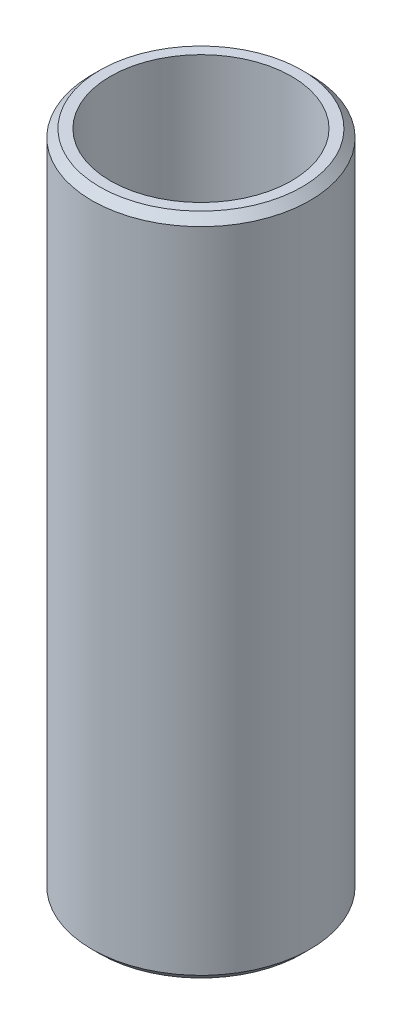
ISO-10303-21;
HEADER;
FILE_DESCRIPTION(('STEP AP214'),'2;1');
FILE_NAME('part.step','',(''),(''),'','','');
FILE_SCHEMA(('AUTOMOTIVE_DESIGN { 1 0 10303 214 1 1 1 1 }'));
ENDSEC;
DATA;
#1=APPLICATION_CONTEXT('core data for automotive mechanical design processes');
#2=APPLICATION_PROTOCOL_DEFINITION('international standard','automotive_design',2000,#1);
#3=PRODUCT_CONTEXT('',#1,'mechanical');
#4=PRODUCT('Part','Part','',(#3));
#5=PRODUCT_RELATED_PRODUCT_CATEGORY('part','',(#4));
#6=PRODUCT_DEFINITION_FORMATION('','',#4);
#7=PRODUCT_DEFINITION_CONTEXT('part definition',#1,'design');
#8=PRODUCT_DEFINITION('design','',#6,#7);
#9=PRODUCT_DEFINITION_SHAPE('','',#8);
#10=(LENGTH_UNIT() NAMED_UNIT(*) SI_UNIT(.MILLI.,.METRE.));
#11=(NAMED_UNIT(*) PLANE_ANGLE_UNIT() SI_UNIT($,.RADIAN.));
#12=(NAMED_UNIT(*) SI_UNIT($,.STERADIAN.) SOLID_ANGLE_UNIT());
#13=UNCERTAINTY_MEASURE_WITH_UNIT(LENGTH_MEASURE(1.E-05),#10,'distance_accuracy_value','');
#14=(GEOMETRIC_REPRESENTATION_CONTEXT(3) GLOBAL_UNCERTAINTY_ASSIGNED_CONTEXT((#13)) GLOBAL_UNIT_ASSIGNED_CONTEXT((#10,
#11,#12)) REPRESENTATION_CONTEXT('',''));
#15=CARTESIAN_POINT('',(0.,0.,0.));
#16=DIRECTION('',(0.,0.,1.));
#17=DIRECTION('',(1.,0.,0.));
#18=AXIS2_PLACEMENT_3D('',#15,#16,#17);
#19=CARTESIAN_POINT('',(0.,197.998398807241,0.));
#20=DIRECTION('',(0.,-1.,0.));
#21=DIRECTION('',(0.,0.,-1.));
#22=AXIS2_PLACEMENT_3D('',#19,#20,#21);
#23=CYLINDRICAL_SURFACE('',#22,32.5);
#24=CARTESIAN_POINT('',(0.,195.649265658549,0.));
#25=DIRECTION('',(0.,1.,0.));
#26=DIRECTION('',(0.,0.,1.));
#27=AXIS2_PLACEMENT_3D('',#24,#25,#26);
#28=CIRCLE('',#27,32.5);
#29=CARTESIAN_POINT('',(0.,195.649265658549,32.5));
#30=VERTEX_POINT('',#29);
#31=EDGE_CURVE('E50',#30,#30,#28,.F.);
#32=ORIENTED_EDGE('',*,*,#31,.T.);
#33=EDGE_LOOP('',(#32));
#34=FACE_BOUND('',#33,.T.);
#35=CARTESIAN_POINT('',(0.,2.34913314869167,0.));
#36=DIRECTION('',(0.,1.,0.));
#37=DIRECTION('',(0.,0.,1.));
#38=AXIS2_PLACEMENT_3D('',#35,#36,#37);
#39=CIRCLE('',#38,32.5);
#40=CARTESIAN_POINT('',(0.,2.34913314869167,32.5));
#41=VERTEX_POINT('',#40);
#42=EDGE_CURVE('E51',#41,#41,#39,.T.);
#43=ORIENTED_EDGE('',*,*,#42,.T.);
#44=EDGE_LOOP('',(#43));
#45=FACE_BOUND('',#44,.T.);
#46=ADVANCED_FACE('F39',(#34,#45),#23,.T.);
#47=CARTESIAN_POINT('',(0.,197.998398807241,0.));
#48=DIRECTION('',(0.,1.,0.));
#49=DIRECTION('',(0.,0.,1.));
#50=AXIS2_PLACEMENT_3D('',#47,#48,#49);
#51=PLANE('',#50);
#52=CARTESIAN_POINT('',(0.,197.998398807241,0.));
#53=DIRECTION('',(0.,1.,0.));
#54=DIRECTION('',(0.,0.,1.));
#55=AXIS2_PLACEMENT_3D('',#52,#53,#54);
#56=CIRCLE('',#55,30.1508668513084);
#57=CARTESIAN_POINT('',(0.,197.998398807241,30.1508668513084));
#58=VERTEX_POINT('',#57);
#59=EDGE_CURVE('E54',#58,#58,#56,.T.);
#60=ORIENTED_EDGE('',*,*,#59,.T.);
#61=EDGE_LOOP('',(#60));
#62=FACE_BOUND('',#61,.T.);
#63=CARTESIAN_POINT('',(0.,197.998398807241,0.));
#64=DIRECTION('',(0.,1.,0.));
#65=DIRECTION('',(0.,0.,1.));
#66=AXIS2_PLACEMENT_3D('',#63,#64,#65);
#67=CIRCLE('',#66,26.9993465408423);
#68=CARTESIAN_POINT('',(0.,197.998398807241,26.9993465408423));
#69=VERTEX_POINT('',#68);
#70=EDGE_CURVE('E58',#69,#69,#67,.T.);
#71=ORIENTED_EDGE('',*,*,#70,.F.);
#72=EDGE_LOOP('',(#71));
#73=FACE_BOUND('',#72,.T.);
#74=ADVANCED_FACE('F69',(#62,#73),#51,.T.);
#75=CARTESIAN_POINT('',(0.,0.,0.));
#76=DIRECTION('',(0.,1.,0.));
#77=DIRECTION('',(0.,0.,1.));
#78=AXIS2_PLACEMENT_3D('',#75,#76,#77);
#79=PLANE('',#78);
#80=CARTESIAN_POINT('',(0.,0.,0.));
#81=DIRECTION('',(0.,1.,0.));
#82=DIRECTION('',(0.,0.,1.));
#83=AXIS2_PLACEMENT_3D('',#80,#81,#82);
#84=CIRCLE('',#83,30.1508668513083);
#85=CARTESIAN_POINT('',(0.,0.,30.1508668513083));
#86=VERTEX_POINT('',#85);
#87=EDGE_CURVE('E10',#86,#86,#84,.F.);
#88=ORIENTED_EDGE('',*,*,#87,.T.);
#89=EDGE_LOOP('',(#88));
#90=FACE_BOUND('',#89,.T.);
#91=CARTESIAN_POINT('',(0.,0.,0.));
#92=DIRECTION('',(0.,1.,0.));
#93=DIRECTION('',(0.,0.,1.));
#94=AXIS2_PLACEMENT_3D('',#91,#92,#93);
#95=CIRCLE('',#94,26.9993465408423);
#96=CARTESIAN_POINT('',(0.,0.,26.9993465408423));
#97=VERTEX_POINT('',#96);
#98=EDGE_CURVE('E63',#97,#97,#95,.T.);
#99=ORIENTED_EDGE('',*,*,#98,.T.);
#100=EDGE_LOOP('',(#99));
#101=FACE_BOUND('',#100,.T.);
#102=ADVANCED_FACE('F75',(#90,#101),#79,.F.);
#103=CARTESIAN_POINT('',(0.,197.998398807241,0.));
#104=DIRECTION('',(0.,-1.,0.));
#105=DIRECTION('',(0.,0.,-1.));
#106=AXIS2_PLACEMENT_3D('',#103,#104,#105);
#107=CYLINDRICAL_SURFACE('',#106,26.9993465408423);
#108=ORIENTED_EDGE('',*,*,#70,.T.);
#109=EDGE_LOOP('',(#108));
#110=FACE_BOUND('',#109,.T.);
#111=ORIENTED_EDGE('',*,*,#98,.F.);
#112=EDGE_LOOP('',(#111));
#113=FACE_BOUND('',#112,.T.);
#114=ADVANCED_FACE('F70',(#110,#113),#107,.F.);
#115=CARTESIAN_POINT('',(0.,197.998398807241,0.));
#116=DIRECTION('',(0.,-1.,0.));
#117=DIRECTION('',(0.,0.,-1.));
#118=AXIS2_PLACEMENT_3D('',#115,#116,#117);
#119=CONICAL_SURFACE('',#118,30.1508668513084,0.785398163397442);
#120=ORIENTED_EDGE('',*,*,#31,.F.);
#121=EDGE_LOOP('',(#120));
#122=FACE_BOUND('',#121,.T.);
#123=ORIENTED_EDGE('',*,*,#59,.F.);
#124=EDGE_LOOP('',(#123));
#125=FACE_BOUND('',#124,.T.);
#126=ADVANCED_FACE('F81',(#122,#125),#119,.T.);
#127=CARTESIAN_POINT('',(0.,2.34913314869167,0.));
#128=DIRECTION('',(0.,1.,0.));
#129=DIRECTION('',(0.,0.,1.));
#130=AXIS2_PLACEMENT_3D('',#127,#128,#129);
#131=CONICAL_SURFACE('',#130,32.5,0.785398163397454);
#132=ORIENTED_EDGE('',*,*,#87,.F.);
#133=EDGE_LOOP('',(#132));
#134=FACE_BOUND('',#133,.T.);
#135=ORIENTED_EDGE('',*,*,#42,.F.);
#136=EDGE_LOOP('',(#135));
#137=FACE_BOUND('',#136,.T.);
#138=ADVANCED_FACE('F45',(#134,#137),#131,.T.);
#139=CLOSED_SHELL('',(#46,#74,#102,#114,#126,#138));
#140=MANIFOLD_SOLID_BREP('B2',#139);
#141=ADVANCED_BREP_SHAPE_REPRESENTATION('',(#18,#140),#14);
#142=SHAPE_DEFINITION_REPRESENTATION(#9,#141);
ENDSEC;
END-ISO-10303-21;
